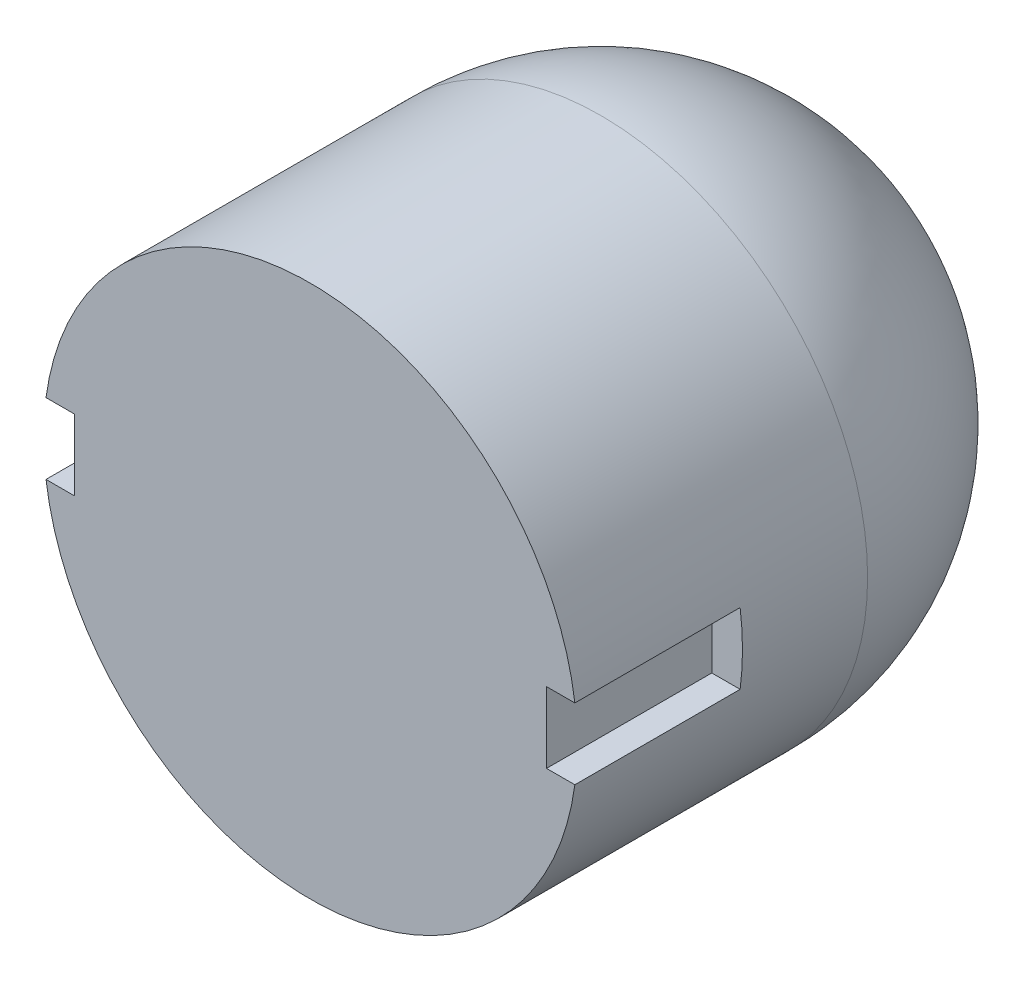
ISO-10303-21;
HEADER;
FILE_DESCRIPTION(('STEP AP214'),'2;1');
FILE_NAME('part.step','',(''),(''),'','','');
FILE_SCHEMA(('AUTOMOTIVE_DESIGN { 1 0 10303 214 1 1 1 1 }'));
ENDSEC;
DATA;
#1=APPLICATION_CONTEXT('core data for automotive mechanical design processes');
#2=APPLICATION_PROTOCOL_DEFINITION('international standard','automotive_design',2000,#1);
#3=PRODUCT_CONTEXT('',#1,'mechanical');
#4=PRODUCT('Part','Part','',(#3));
#5=PRODUCT_RELATED_PRODUCT_CATEGORY('part','',(#4));
#6=PRODUCT_DEFINITION_FORMATION('','',#4);
#7=PRODUCT_DEFINITION_CONTEXT('part definition',#1,'design');
#8=PRODUCT_DEFINITION('design','',#6,#7);
#9=PRODUCT_DEFINITION_SHAPE('','',#8);
#10=(LENGTH_UNIT() NAMED_UNIT(*) SI_UNIT(.MILLI.,.METRE.));
#11=(NAMED_UNIT(*) PLANE_ANGLE_UNIT() SI_UNIT($,.RADIAN.));
#12=(NAMED_UNIT(*) SI_UNIT($,.STERADIAN.) SOLID_ANGLE_UNIT());
#13=UNCERTAINTY_MEASURE_WITH_UNIT(LENGTH_MEASURE(1.E-05),#10,'distance_accuracy_value','');
#14=(GEOMETRIC_REPRESENTATION_CONTEXT(3) GLOBAL_UNCERTAINTY_ASSIGNED_CONTEXT((#13)) GLOBAL_UNIT_ASSIGNED_CONTEXT((#10,
#11,#12)) REPRESENTATION_CONTEXT('',''));
#15=CARTESIAN_POINT('',(0.,0.,0.));
#16=DIRECTION('',(0.,0.,1.));
#17=DIRECTION('',(1.,0.,0.));
#18=AXIS2_PLACEMENT_3D('',#15,#16,#17);
#19=CARTESIAN_POINT('',(0.,0.,6.15));
#20=DIRECTION('',(0.,0.,-1.));
#21=DIRECTION('',(-1.,0.,0.));
#22=AXIS2_PLACEMENT_3D('',#19,#20,#21);
#23=CYLINDRICAL_SURFACE('',#22,5.65);
#24=CARTESIAN_POINT('',(0.,0.,0.));
#25=DIRECTION('',(0.,0.,1.));
#26=DIRECTION('',(1.,0.,0.));
#27=AXIS2_PLACEMENT_3D('',#24,#25,#26);
#28=CIRCLE('',#27,5.65);
#29=CARTESIAN_POINT('',(5.65,0.,0.));
#30=VERTEX_POINT('',#29);
#31=EDGE_CURVE('E40',#30,#30,#28,.T.);
#32=ORIENTED_EDGE('',*,*,#31,.T.);
#33=EDGE_LOOP('',(#32));
#34=FACE_BOUND('',#33,.T.);
#35=DIRECTION('',(0.,0.,-1.));
#36=VECTOR('',#35,1.);
#37=CARTESIAN_POINT('',(5.6,0.75,6.15));
#38=LINE('',#37,#36);
#39=CARTESIAN_POINT('',(5.6,0.75,6.15));
#40=VERTEX_POINT('',#39);
#41=CARTESIAN_POINT('',(5.6,0.75,2.65));
#42=VERTEX_POINT('',#41);
#43=EDGE_CURVE('E104',#40,#42,#38,.T.);
#44=ORIENTED_EDGE('',*,*,#43,.T.);
#45=CARTESIAN_POINT('',(0.,0.,2.65));
#46=DIRECTION('',(0.,0.,1.));
#47=DIRECTION('',(0.,-1.,0.));
#48=AXIS2_PLACEMENT_3D('',#45,#46,#47);
#49=CIRCLE('',#48,5.65);
#50=CARTESIAN_POINT('',(5.6,-0.75,2.65));
#51=VERTEX_POINT('',#50);
#52=EDGE_CURVE('E114',#42,#51,#49,.F.);
#53=ORIENTED_EDGE('',*,*,#52,.T.);
#54=DIRECTION('',(0.,0.,-1.));
#55=VECTOR('',#54,1.);
#56=CARTESIAN_POINT('',(5.6,-0.75,6.15));
#57=LINE('',#56,#55);
#58=CARTESIAN_POINT('',(5.6,-0.75,6.15));
#59=VERTEX_POINT('',#58);
#60=EDGE_CURVE('E154',#51,#59,#57,.F.);
#61=ORIENTED_EDGE('',*,*,#60,.T.);
#62=CARTESIAN_POINT('',(0.,0.,6.15));
#63=DIRECTION('',(0.,0.,1.));
#64=DIRECTION('',(1.,0.,0.));
#65=AXIS2_PLACEMENT_3D('',#62,#63,#64);
#66=CIRCLE('',#65,5.65);
#67=CARTESIAN_POINT('',(-5.6,-0.75,6.15));
#68=VERTEX_POINT('',#67);
#69=EDGE_CURVE('E11',#68,#59,#66,.T.);
#70=ORIENTED_EDGE('',*,*,#69,.F.);
#71=DIRECTION('',(0.,0.,-1.));
#72=VECTOR('',#71,1.);
#73=CARTESIAN_POINT('',(-5.6,-0.75,6.15));
#74=LINE('',#73,#72);
#75=CARTESIAN_POINT('',(-5.6,-0.75,2.65));
#76=VERTEX_POINT('',#75);
#77=EDGE_CURVE('E149',#76,#68,#74,.F.);
#78=ORIENTED_EDGE('',*,*,#77,.F.);
#79=CARTESIAN_POINT('',(0.,0.,2.65));
#80=DIRECTION('',(0.,0.,-1.));
#81=DIRECTION('',(0.,1.,0.));
#82=AXIS2_PLACEMENT_3D('',#79,#80,#81);
#83=CIRCLE('',#82,5.65);
#84=CARTESIAN_POINT('',(-5.6,0.75,2.65));
#85=VERTEX_POINT('',#84);
#86=EDGE_CURVE('E151',#85,#76,#83,.F.);
#87=ORIENTED_EDGE('',*,*,#86,.F.);
#88=DIRECTION('',(0.,0.,-1.));
#89=VECTOR('',#88,1.);
#90=CARTESIAN_POINT('',(-5.6,0.75,6.15));
#91=LINE('',#90,#89);
#92=CARTESIAN_POINT('',(-5.6,0.75,6.15));
#93=VERTEX_POINT('',#92);
#94=EDGE_CURVE('E127',#93,#85,#91,.T.);
#95=ORIENTED_EDGE('',*,*,#94,.F.);
#96=EDGE_CURVE('E45',#40,#93,#66,.T.);
#97=ORIENTED_EDGE('',*,*,#96,.F.);
#98=EDGE_LOOP('',(#44,#53,#61,#70,#78,#87,#95,#97));
#99=FACE_BOUND('',#98,.T.);
#100=ADVANCED_FACE('F36',(#34,#99),#23,.T.);
#101=CARTESIAN_POINT('',(0.,0.,6.15));
#102=DIRECTION('',(0.,0.,1.));
#103=DIRECTION('',(1.,0.,0.));
#104=AXIS2_PLACEMENT_3D('',#101,#102,#103);
#105=PLANE('',#104);
#106=DIRECTION('',(0.,-1.,0.));
#107=VECTOR('',#106,1.);
#108=CARTESIAN_POINT('',(5.,0.75,6.15));
#109=LINE('',#108,#107);
#110=CARTESIAN_POINT('',(5.,0.75,6.15));
#111=VERTEX_POINT('',#110);
#112=CARTESIAN_POINT('',(5.,-0.75,6.15));
#113=VERTEX_POINT('',#112);
#114=EDGE_CURVE('E121',#111,#113,#109,.T.);
#115=ORIENTED_EDGE('',*,*,#114,.F.);
#116=DIRECTION('',(-1.,0.,0.));
#117=VECTOR('',#116,1.);
#118=CARTESIAN_POINT('',(5.651,0.75,6.15));
#119=LINE('',#118,#117);
#120=EDGE_CURVE('E107',#40,#111,#119,.T.);
#121=ORIENTED_EDGE('',*,*,#120,.F.);
#122=ORIENTED_EDGE('',*,*,#96,.T.);
#123=DIRECTION('',(1.,0.,0.));
#124=VECTOR('',#123,1.);
#125=CARTESIAN_POINT('',(-5.651,0.75,6.15));
#126=LINE('',#125,#124);
#127=CARTESIAN_POINT('',(-5.,0.75,6.15));
#128=VERTEX_POINT('',#127);
#129=EDGE_CURVE('E134',#93,#128,#126,.T.);
#130=ORIENTED_EDGE('',*,*,#129,.T.);
#131=DIRECTION('',(0.,-1.,0.));
#132=VECTOR('',#131,1.);
#133=CARTESIAN_POINT('',(-5.,0.75,6.15));
#134=LINE('',#133,#132);
#135=CARTESIAN_POINT('',(-5.,-0.75,6.15));
#136=VERTEX_POINT('',#135);
#137=EDGE_CURVE('E140',#128,#136,#134,.T.);
#138=ORIENTED_EDGE('',*,*,#137,.T.);
#139=DIRECTION('',(1.,0.,0.));
#140=VECTOR('',#139,1.);
#141=CARTESIAN_POINT('',(-5.651,-0.75,6.15));
#142=LINE('',#141,#140);
#143=EDGE_CURVE('E136',#68,#136,#142,.T.);
#144=ORIENTED_EDGE('',*,*,#143,.F.);
#145=ORIENTED_EDGE('',*,*,#69,.T.);
#146=DIRECTION('',(-1.,0.,0.));
#147=VECTOR('',#146,1.);
#148=CARTESIAN_POINT('',(5.651,-0.75,6.15));
#149=LINE('',#148,#147);
#150=EDGE_CURVE('E122',#59,#113,#149,.T.);
#151=ORIENTED_EDGE('',*,*,#150,.T.);
#152=EDGE_LOOP('',(#115,#121,#122,#130,#138,#144,#145,#151));
#153=FACE_BOUND('',#152,.T.);
#154=ADVANCED_FACE('F117',(#153),#105,.T.);
#155=CARTESIAN_POINT('',(0.,0.,0.));
#156=DIRECTION('',(0.,-1.,0.));
#157=DIRECTION('',(1.,0.,0.));
#158=AXIS2_PLACEMENT_3D('',#155,#156,#157);
#159=SPHERICAL_SURFACE('',#158,5.65);
#160=CARTESIAN_POINT('',(0.,0.,0.));
#161=DIRECTION('',(0.,0.,1.));
#162=DIRECTION('',(1.,0.,0.));
#163=AXIS2_PLACEMENT_3D('',#160,#161,#162);
#164=SPHERICAL_SURFACE('',#163,5.65);
#165=ORIENTED_EDGE('',*,*,#31,.F.);
#166=EDGE_LOOP('',(#165));
#167=FACE_BOUND('',#166,.T.);
#168=ADVANCED_FACE('F38',(#167),#164,.T.);
#169=CARTESIAN_POINT('',(-5.651,0.75,2.65));
#170=DIRECTION('',(0.,0.,-1.));
#171=DIRECTION('',(0.,1.,0.));
#172=AXIS2_PLACEMENT_3D('',#169,#170,#171);
#173=PLANE('',#172);
#174=ORIENTED_EDGE('',*,*,#86,.T.);
#175=DIRECTION('',(1.,0.,0.));
#176=VECTOR('',#175,1.);
#177=CARTESIAN_POINT('',(-5.651,-0.75,2.65));
#178=LINE('',#177,#176);
#179=CARTESIAN_POINT('',(-5.,-0.75,2.65));
#180=VERTEX_POINT('',#179);
#181=EDGE_CURVE('E131',#76,#180,#178,.T.);
#182=ORIENTED_EDGE('',*,*,#181,.T.);
#183=DIRECTION('',(0.,1.,0.));
#184=VECTOR('',#183,1.);
#185=CARTESIAN_POINT('',(-5.,0.75,2.65));
#186=LINE('',#185,#184);
#187=CARTESIAN_POINT('',(-5.,0.75,2.65));
#188=VERTEX_POINT('',#187);
#189=EDGE_CURVE('E146',#180,#188,#186,.T.);
#190=ORIENTED_EDGE('',*,*,#189,.T.);
#191=DIRECTION('',(1.,0.,0.));
#192=VECTOR('',#191,1.);
#193=CARTESIAN_POINT('',(-5.651,0.75,2.65));
#194=LINE('',#193,#192);
#195=EDGE_CURVE('E132',#85,#188,#194,.T.);
#196=ORIENTED_EDGE('',*,*,#195,.F.);
#197=EDGE_LOOP('',(#174,#182,#190,#196));
#198=FACE_BOUND('',#197,.T.);
#199=ADVANCED_FACE('F190',(#198),#173,.F.);
#200=CARTESIAN_POINT('',(-5.651,-0.75,6.15));
#201=DIRECTION('',(0.,-1.,0.));
#202=DIRECTION('',(0.,0.,-1.));
#203=AXIS2_PLACEMENT_3D('',#200,#201,#202);
#204=PLANE('',#203);
#205=ORIENTED_EDGE('',*,*,#77,.T.);
#206=ORIENTED_EDGE('',*,*,#143,.T.);
#207=DIRECTION('',(0.,0.,-1.));
#208=VECTOR('',#207,1.);
#209=CARTESIAN_POINT('',(-5.,-0.75,6.15));
#210=LINE('',#209,#208);
#211=EDGE_CURVE('E60',#136,#180,#210,.T.);
#212=ORIENTED_EDGE('',*,*,#211,.T.);
#213=ORIENTED_EDGE('',*,*,#181,.F.);
#214=EDGE_LOOP('',(#205,#206,#212,#213));
#215=FACE_BOUND('',#214,.T.);
#216=ADVANCED_FACE('F193',(#215),#204,.F.);
#217=CARTESIAN_POINT('',(-5.651,0.75,6.15));
#218=DIRECTION('',(0.,1.,0.));
#219=DIRECTION('',(0.,0.,1.));
#220=AXIS2_PLACEMENT_3D('',#217,#218,#219);
#221=PLANE('',#220);
#222=ORIENTED_EDGE('',*,*,#94,.T.);
#223=ORIENTED_EDGE('',*,*,#195,.T.);
#224=DIRECTION('',(0.,0.,1.));
#225=VECTOR('',#224,1.);
#226=CARTESIAN_POINT('',(-5.,0.75,6.15));
#227=LINE('',#226,#225);
#228=EDGE_CURVE('E143',#188,#128,#227,.T.);
#229=ORIENTED_EDGE('',*,*,#228,.T.);
#230=ORIENTED_EDGE('',*,*,#129,.F.);
#231=EDGE_LOOP('',(#222,#223,#229,#230));
#232=FACE_BOUND('',#231,.T.);
#233=ADVANCED_FACE('F195',(#232),#221,.F.);
#234=CARTESIAN_POINT('',(-5.,0.,0.));
#235=DIRECTION('',(1.,0.,0.));
#236=DIRECTION('',(0.,0.,-1.));
#237=AXIS2_PLACEMENT_3D('',#234,#235,#236);
#238=PLANE('',#237);
#239=ORIENTED_EDGE('',*,*,#189,.F.);
#240=ORIENTED_EDGE('',*,*,#211,.F.);
#241=ORIENTED_EDGE('',*,*,#137,.F.);
#242=ORIENTED_EDGE('',*,*,#228,.F.);
#243=EDGE_LOOP('',(#239,#240,#241,#242));
#244=FACE_BOUND('',#243,.T.);
#245=ADVANCED_FACE('F198',(#244),#238,.F.);
#246=CARTESIAN_POINT('',(5.651,0.75,2.65));
#247=DIRECTION('',(0.,0.,1.));
#248=DIRECTION('',(0.,-1.,0.));
#249=AXIS2_PLACEMENT_3D('',#246,#247,#248);
#250=PLANE('',#249);
#251=DIRECTION('',(-1.,0.,0.));
#252=VECTOR('',#251,1.);
#253=CARTESIAN_POINT('',(5.651,0.75,2.65));
#254=LINE('',#253,#252);
#255=CARTESIAN_POINT('',(5.,0.75,2.65));
#256=VERTEX_POINT('',#255);
#257=EDGE_CURVE('E109',#42,#256,#254,.T.);
#258=ORIENTED_EDGE('',*,*,#257,.T.);
#259=DIRECTION('',(0.,1.,0.));
#260=VECTOR('',#259,1.);
#261=CARTESIAN_POINT('',(5.,0.75,2.65));
#262=LINE('',#261,#260);
#263=CARTESIAN_POINT('',(5.,-0.75,2.65));
#264=VERTEX_POINT('',#263);
#265=EDGE_CURVE('E113',#264,#256,#262,.T.);
#266=ORIENTED_EDGE('',*,*,#265,.F.);
#267=DIRECTION('',(-1.,0.,0.));
#268=VECTOR('',#267,1.);
#269=CARTESIAN_POINT('',(5.651,-0.75,2.65));
#270=LINE('',#269,#268);
#271=EDGE_CURVE('E159',#51,#264,#270,.T.);
#272=ORIENTED_EDGE('',*,*,#271,.F.);
#273=ORIENTED_EDGE('',*,*,#52,.F.);
#274=EDGE_LOOP('',(#258,#266,#272,#273));
#275=FACE_BOUND('',#274,.T.);
#276=ADVANCED_FACE('F170',(#275),#250,.T.);
#277=CARTESIAN_POINT('',(5.651,0.75,6.15));
#278=DIRECTION('',(0.,-1.,0.));
#279=DIRECTION('',(0.,0.,-1.));
#280=AXIS2_PLACEMENT_3D('',#277,#278,#279);
#281=PLANE('',#280);
#282=ORIENTED_EDGE('',*,*,#120,.T.);
#283=DIRECTION('',(0.,0.,1.));
#284=VECTOR('',#283,1.);
#285=CARTESIAN_POINT('',(5.,0.75,6.15));
#286=LINE('',#285,#284);
#287=EDGE_CURVE('E52',#256,#111,#286,.T.);
#288=ORIENTED_EDGE('',*,*,#287,.F.);
#289=ORIENTED_EDGE('',*,*,#257,.F.);
#290=ORIENTED_EDGE('',*,*,#43,.F.);
#291=EDGE_LOOP('',(#282,#288,#289,#290));
#292=FACE_BOUND('',#291,.T.);
#293=ADVANCED_FACE('F106',(#292),#281,.T.);
#294=CARTESIAN_POINT('',(5.651,-0.75,6.15));
#295=DIRECTION('',(0.,1.,0.));
#296=DIRECTION('',(0.,0.,1.));
#297=AXIS2_PLACEMENT_3D('',#294,#295,#296);
#298=PLANE('',#297);
#299=ORIENTED_EDGE('',*,*,#271,.T.);
#300=DIRECTION('',(0.,0.,-1.));
#301=VECTOR('',#300,1.);
#302=CARTESIAN_POINT('',(5.,-0.75,6.15));
#303=LINE('',#302,#301);
#304=EDGE_CURVE('E161',#113,#264,#303,.T.);
#305=ORIENTED_EDGE('',*,*,#304,.F.);
#306=ORIENTED_EDGE('',*,*,#150,.F.);
#307=ORIENTED_EDGE('',*,*,#60,.F.);
#308=EDGE_LOOP('',(#299,#305,#306,#307));
#309=FACE_BOUND('',#308,.T.);
#310=ADVANCED_FACE('F174',(#309),#298,.T.);
#311=CARTESIAN_POINT('',(5.,0.,0.));
#312=DIRECTION('',(1.,0.,0.));
#313=DIRECTION('',(0.,0.,-1.));
#314=AXIS2_PLACEMENT_3D('',#311,#312,#313);
#315=PLANE('',#314);
#316=ORIENTED_EDGE('',*,*,#265,.T.);
#317=ORIENTED_EDGE('',*,*,#287,.T.);
#318=ORIENTED_EDGE('',*,*,#114,.T.);
#319=ORIENTED_EDGE('',*,*,#304,.T.);
#320=EDGE_LOOP('',(#316,#317,#318,#319));
#321=FACE_BOUND('',#320,.T.);
#322=ADVANCED_FACE('F175',(#321),#315,.T.);
#323=CLOSED_SHELL('',(#100,#154,#168,#199,#216,#233,#245,#276,#293,#310,#322));
#324=MANIFOLD_SOLID_BREP('B2',#323);
#325=ADVANCED_BREP_SHAPE_REPRESENTATION('',(#18,#324),#14);
#326=SHAPE_DEFINITION_REPRESENTATION(#9,#325);
ENDSEC;
END-ISO-10303-21;
